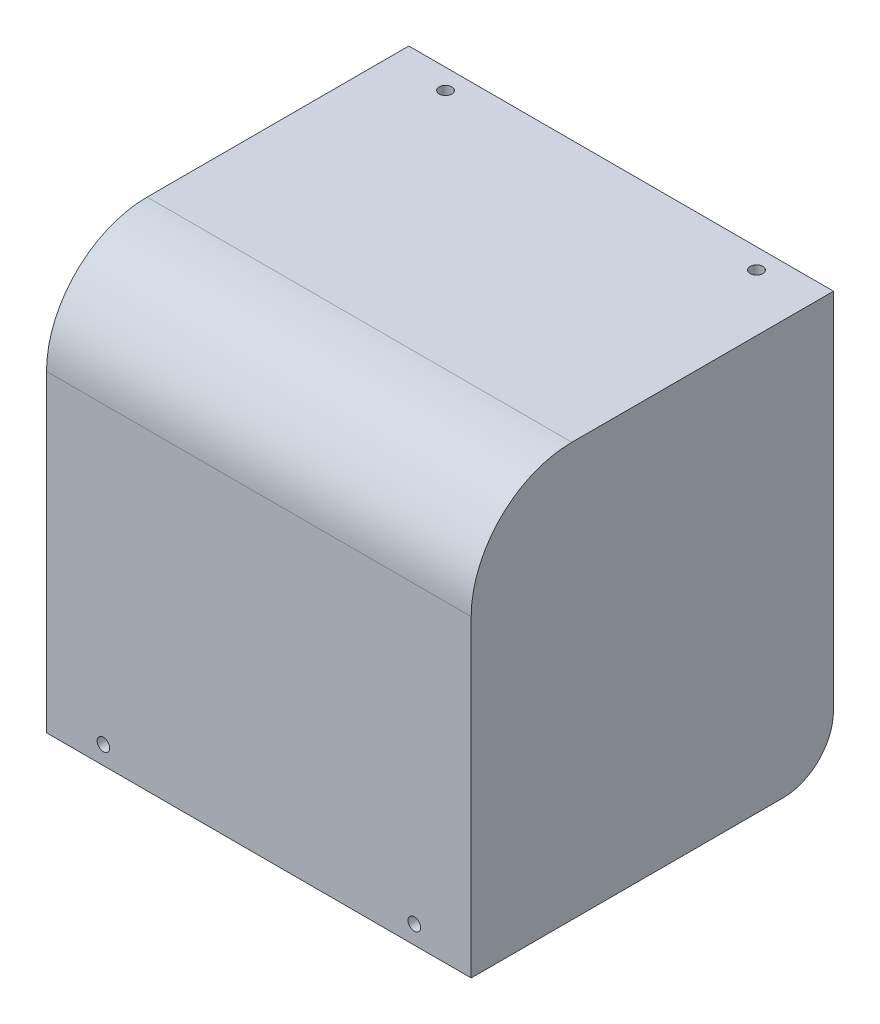
ISO-10303-21;
HEADER;
FILE_DESCRIPTION(('STEP AP214'),'2;1');
FILE_NAME('part.step','',(''),(''),'','','');
FILE_SCHEMA(('AUTOMOTIVE_DESIGN { 1 0 10303 214 1 1 1 1 }'));
ENDSEC;
DATA;
#1=APPLICATION_CONTEXT('core data for automotive mechanical design processes');
#2=APPLICATION_PROTOCOL_DEFINITION('international standard','automotive_design',2000,#1);
#3=PRODUCT_CONTEXT('',#1,'mechanical');
#4=PRODUCT('Part','Part','',(#3));
#5=PRODUCT_RELATED_PRODUCT_CATEGORY('part','',(#4));
#6=PRODUCT_DEFINITION_FORMATION('','',#4);
#7=PRODUCT_DEFINITION_CONTEXT('part definition',#1,'design');
#8=PRODUCT_DEFINITION('design','',#6,#7);
#9=PRODUCT_DEFINITION_SHAPE('','',#8);
#10=(LENGTH_UNIT() NAMED_UNIT(*) SI_UNIT(.MILLI.,.METRE.));
#11=(NAMED_UNIT(*) PLANE_ANGLE_UNIT() SI_UNIT($,.RADIAN.));
#12=(NAMED_UNIT(*) SI_UNIT($,.STERADIAN.) SOLID_ANGLE_UNIT());
#13=UNCERTAINTY_MEASURE_WITH_UNIT(LENGTH_MEASURE(1.E-05),#10,'distance_accuracy_value','');
#14=(GEOMETRIC_REPRESENTATION_CONTEXT(3) GLOBAL_UNCERTAINTY_ASSIGNED_CONTEXT((#13)) GLOBAL_UNIT_ASSIGNED_CONTEXT((#10,
#11,#12)) REPRESENTATION_CONTEXT('',''));
#15=CARTESIAN_POINT('',(0.,0.,0.));
#16=DIRECTION('',(0.,0.,1.));
#17=DIRECTION('',(1.,0.,0.));
#18=AXIS2_PLACEMENT_3D('',#15,#16,#17);
#19=CARTESIAN_POINT('',(42.2,80.2,-1.99999999999999));
#20=DIRECTION('',(0.,0.,1.));
#21=DIRECTION('',(0.,-1.,0.));
#22=AXIS2_PLACEMENT_3D('',#19,#20,#21);
#23=PLANE('',#22);
#24=CARTESIAN_POINT('',(-30.9,3.64,-2.));
#25=DIRECTION('',(0.,0.,1.));
#26=DIRECTION('',(0.,-1.,0.));
#27=AXIS2_PLACEMENT_3D('',#24,#25,#26);
#28=CIRCLE('',#27,1.25);
#29=CARTESIAN_POINT('',(-30.9,2.39,-2.));
#30=VERTEX_POINT('',#29);
#31=EDGE_CURVE('E216',#30,#30,#28,.T.);
#32=ORIENTED_EDGE('',*,*,#31,.T.);
#33=EDGE_LOOP('',(#32));
#34=FACE_BOUND('',#33,.T.);
#35=CARTESIAN_POINT('',(30.9,3.64000000000001,-2.));
#36=DIRECTION('',(0.,0.,1.));
#37=DIRECTION('',(0.,-1.,0.));
#38=AXIS2_PLACEMENT_3D('',#35,#36,#37);
#39=CIRCLE('',#38,1.25);
#40=CARTESIAN_POINT('',(30.9,2.39000000000001,-2.));
#41=VERTEX_POINT('',#40);
#42=EDGE_CURVE('E211',#41,#41,#39,.T.);
#43=ORIENTED_EDGE('',*,*,#42,.T.);
#44=EDGE_LOOP('',(#43));
#45=FACE_BOUND('',#44,.T.);
#46=DIRECTION('',(0.,1.,0.));
#47=VECTOR('',#46,1.);
#48=CARTESIAN_POINT('',(40.2,0.,-2.));
#49=LINE('',#48,#47);
#50=CARTESIAN_POINT('',(40.2,0.,-2.));
#51=VERTEX_POINT('',#50);
#52=CARTESIAN_POINT('',(40.2,60.2,-1.99999999999999));
#53=VERTEX_POINT('',#52);
#54=EDGE_CURVE('E126',#51,#53,#49,.T.);
#55=ORIENTED_EDGE('',*,*,#54,.F.);
#56=DIRECTION('',(-1.,0.,0.));
#57=VECTOR('',#56,1.);
#58=CARTESIAN_POINT('',(42.2,0.,-2.));
#59=LINE('',#58,#57);
#60=CARTESIAN_POINT('',(-40.2,0.,-2.));
#61=VERTEX_POINT('',#60);
#62=EDGE_CURVE('E191',#51,#61,#59,.T.);
#63=ORIENTED_EDGE('',*,*,#62,.T.);
#64=DIRECTION('',(0.,1.,0.));
#65=VECTOR('',#64,1.);
#66=CARTESIAN_POINT('',(-40.2,0.,-2.));
#67=LINE('',#66,#65);
#68=CARTESIAN_POINT('',(-40.2,60.2,-1.99999999999999));
#69=VERTEX_POINT('',#68);
#70=EDGE_CURVE('E203',#61,#69,#67,.T.);
#71=ORIENTED_EDGE('',*,*,#70,.T.);
#72=DIRECTION('',(-1.,0.,0.));
#73=VECTOR('',#72,1.);
#74=CARTESIAN_POINT('',(42.2,60.2,-1.99999999999999));
#75=LINE('',#74,#73);
#76=EDGE_CURVE('E143',#69,#53,#75,.F.);
#77=ORIENTED_EDGE('',*,*,#76,.T.);
#78=EDGE_LOOP('',(#55,#63,#71,#77));
#79=FACE_BOUND('',#78,.T.);
#80=ADVANCED_FACE('F33',(#34,#45,#79),#23,.F.);
#81=CARTESIAN_POINT('',(42.2,80.2,-72.));
#82=DIRECTION('',(0.,1.,0.));
#83=DIRECTION('',(0.,0.,1.));
#84=AXIS2_PLACEMENT_3D('',#81,#82,#83);
#85=PLANE('',#84);
#86=CARTESIAN_POINT('',(-30.9,80.2,-68.001968));
#87=DIRECTION('',(0.,1.,0.));
#88=DIRECTION('',(0.,0.,1.));
#89=AXIS2_PLACEMENT_3D('',#86,#87,#88);
#90=CIRCLE('',#89,1.25);
#91=CARTESIAN_POINT('',(-30.9,80.2,-66.751968));
#92=VERTEX_POINT('',#91);
#93=EDGE_CURVE('E138',#92,#92,#90,.T.);
#94=ORIENTED_EDGE('',*,*,#93,.T.);
#95=EDGE_LOOP('',(#94));
#96=FACE_BOUND('',#95,.T.);
#97=CARTESIAN_POINT('',(30.9,80.2,-68.001968));
#98=DIRECTION('',(0.,1.,0.));
#99=DIRECTION('',(0.,0.,1.));
#100=AXIS2_PLACEMENT_3D('',#97,#98,#99);
#101=CIRCLE('',#100,1.25);
#102=CARTESIAN_POINT('',(30.9,80.2,-66.751968));
#103=VERTEX_POINT('',#102);
#104=EDGE_CURVE('E329',#103,#103,#101,.T.);
#105=ORIENTED_EDGE('',*,*,#104,.T.);
#106=EDGE_LOOP('',(#105));
#107=FACE_BOUND('',#106,.T.);
#108=DIRECTION('',(0.,0.,-1.));
#109=VECTOR('',#108,1.);
#110=CARTESIAN_POINT('',(40.2,80.2,-22.));
#111=LINE('',#110,#109);
#112=CARTESIAN_POINT('',(40.2,80.2,-22.));
#113=VERTEX_POINT('',#112);
#114=CARTESIAN_POINT('',(40.2,80.2,-72.));
#115=VERTEX_POINT('',#114);
#116=EDGE_CURVE('E123',#113,#115,#111,.T.);
#117=ORIENTED_EDGE('',*,*,#116,.F.);
#118=DIRECTION('',(-1.,0.,0.));
#119=VECTOR('',#118,1.);
#120=CARTESIAN_POINT('',(-42.2,80.2,-22.));
#121=LINE('',#120,#119);
#122=CARTESIAN_POINT('',(-40.2,80.2,-22.));
#123=VERTEX_POINT('',#122);
#124=EDGE_CURVE('E135',#113,#123,#121,.T.);
#125=ORIENTED_EDGE('',*,*,#124,.T.);
#126=DIRECTION('',(0.,0.,-1.));
#127=VECTOR('',#126,1.);
#128=CARTESIAN_POINT('',(-40.2,80.2,-22.));
#129=LINE('',#128,#127);
#130=CARTESIAN_POINT('',(-40.2,80.2,-72.));
#131=VERTEX_POINT('',#130);
#132=EDGE_CURVE('E194',#123,#131,#129,.T.);
#133=ORIENTED_EDGE('',*,*,#132,.T.);
#134=DIRECTION('',(-1.,0.,0.));
#135=VECTOR('',#134,1.);
#136=CARTESIAN_POINT('',(42.2,80.2,-72.));
#137=LINE('',#136,#135);
#138=EDGE_CURVE('E137',#115,#131,#137,.T.);
#139=ORIENTED_EDGE('',*,*,#138,.F.);
#140=EDGE_LOOP('',(#117,#125,#133,#139));
#141=FACE_BOUND('',#140,.T.);
#142=ADVANCED_FACE('F133',(#96,#107,#141),#85,.F.);
#143=CARTESIAN_POINT('',(42.2,60.2,-22.));
#144=DIRECTION('',(1.,0.,0.));
#145=DIRECTION('',(0.,0.,-1.));
#146=AXIS2_PLACEMENT_3D('',#143,#144,#145);
#147=CYLINDRICAL_SURFACE('',#146,20.);
#148=CARTESIAN_POINT('',(40.2,60.2,-22.));
#149=DIRECTION('',(-1.,0.,0.));
#150=DIRECTION('',(0.,0.,1.));
#151=AXIS2_PLACEMENT_3D('',#148,#149,#150);
#152=CIRCLE('',#151,20.);
#153=EDGE_CURVE('E120',#53,#113,#152,.T.);
#154=ORIENTED_EDGE('',*,*,#153,.F.);
#155=ORIENTED_EDGE('',*,*,#76,.F.);
#156=CARTESIAN_POINT('',(-40.2,60.2,-22.));
#157=DIRECTION('',(-1.,0.,0.));
#158=DIRECTION('',(0.,0.,1.));
#159=AXIS2_PLACEMENT_3D('',#156,#157,#158);
#160=CIRCLE('',#159,20.);
#161=EDGE_CURVE('E142',#69,#123,#160,.T.);
#162=ORIENTED_EDGE('',*,*,#161,.T.);
#163=ORIENTED_EDGE('',*,*,#124,.F.);
#164=EDGE_LOOP('',(#154,#155,#162,#163));
#165=FACE_BOUND('',#164,.T.);
#166=ADVANCED_FACE('F141',(#165),#147,.F.);
#167=CARTESIAN_POINT('',(42.2,0.,-2.));
#168=DIRECTION('',(0.,1.,0.));
#169=DIRECTION('',(0.,0.,1.));
#170=AXIS2_PLACEMENT_3D('',#167,#168,#169);
#171=PLANE('',#170);
#172=DIRECTION('',(0.,0.,-1.));
#173=VECTOR('',#172,1.);
#174=CARTESIAN_POINT('',(-42.2,0.,-2.));
#175=LINE('',#174,#173);
#176=CARTESIAN_POINT('',(-42.2,0.,0.));
#177=VERTEX_POINT('',#176);
#178=CARTESIAN_POINT('',(-42.2,0.,-62.));
#179=VERTEX_POINT('',#178);
#180=EDGE_CURVE('E219',#177,#179,#175,.T.);
#181=ORIENTED_EDGE('',*,*,#180,.T.);
#182=DIRECTION('',(-1.,0.,0.));
#183=VECTOR('',#182,1.);
#184=CARTESIAN_POINT('',(42.2,0.,-62.));
#185=LINE('',#184,#183);
#186=CARTESIAN_POINT('',(-40.2,0.,-62.));
#187=VERTEX_POINT('',#186);
#188=EDGE_CURVE('E164',#179,#187,#185,.F.);
#189=ORIENTED_EDGE('',*,*,#188,.T.);
#190=DIRECTION('',(0.,0.,1.));
#191=VECTOR('',#190,1.);
#192=CARTESIAN_POINT('',(-40.2,0.,-72.));
#193=LINE('',#192,#191);
#194=EDGE_CURVE('E201',#187,#61,#193,.T.);
#195=ORIENTED_EDGE('',*,*,#194,.T.);
#196=ORIENTED_EDGE('',*,*,#62,.F.);
#197=DIRECTION('',(0.,0.,1.));
#198=VECTOR('',#197,1.);
#199=CARTESIAN_POINT('',(40.2,0.,-72.));
#200=LINE('',#199,#198);
#201=CARTESIAN_POINT('',(40.2,0.,-62.));
#202=VERTEX_POINT('',#201);
#203=EDGE_CURVE('E189',#202,#51,#200,.T.);
#204=ORIENTED_EDGE('',*,*,#203,.F.);
#205=DIRECTION('',(1.,0.,0.));
#206=VECTOR('',#205,1.);
#207=CARTESIAN_POINT('',(42.2,0.,-62.));
#208=LINE('',#207,#206);
#209=CARTESIAN_POINT('',(42.2,0.,-62.));
#210=VERTEX_POINT('',#209);
#211=EDGE_CURVE('E162',#202,#210,#208,.T.);
#212=ORIENTED_EDGE('',*,*,#211,.T.);
#213=DIRECTION('',(0.,0.,-1.));
#214=VECTOR('',#213,1.);
#215=CARTESIAN_POINT('',(42.2,0.,-2.));
#216=LINE('',#215,#214);
#217=CARTESIAN_POINT('',(42.2,0.,0.));
#218=VERTEX_POINT('',#217);
#219=EDGE_CURVE('E175',#218,#210,#216,.T.);
#220=ORIENTED_EDGE('',*,*,#219,.F.);
#221=DIRECTION('',(-1.,0.,0.));
#222=VECTOR('',#221,1.);
#223=CARTESIAN_POINT('',(42.2,0.,0.));
#224=LINE('',#223,#222);
#225=EDGE_CURVE('E225',#218,#177,#224,.T.);
#226=ORIENTED_EDGE('',*,*,#225,.T.);
#227=EDGE_LOOP('',(#181,#189,#195,#196,#204,#212,#220,#226));
#228=FACE_BOUND('',#227,.T.);
#229=ADVANCED_FACE('F186',(#228),#171,.F.);
#230=CARTESIAN_POINT('',(42.2,82.2,-72.));
#231=DIRECTION('',(0.,0.,1.));
#232=DIRECTION('',(1.,0.,0.));
#233=AXIS2_PLACEMENT_3D('',#230,#231,#232);
#234=PLANE('',#233);
#235=DIRECTION('',(0.,-1.,0.));
#236=VECTOR('',#235,1.);
#237=CARTESIAN_POINT('',(-40.2,80.2,-72.));
#238=LINE('',#237,#236);
#239=CARTESIAN_POINT('',(-40.2,9.99999999999995,-72.));
#240=VERTEX_POINT('',#239);
#241=EDGE_CURVE('E199',#131,#240,#238,.T.);
#242=ORIENTED_EDGE('',*,*,#241,.T.);
#243=DIRECTION('',(-1.,0.,0.));
#244=VECTOR('',#243,1.);
#245=CARTESIAN_POINT('',(42.2,9.99999999999995,-72.));
#246=LINE('',#245,#244);
#247=CARTESIAN_POINT('',(-42.2,9.99999999999995,-72.));
#248=VERTEX_POINT('',#247);
#249=EDGE_CURVE('E157',#240,#248,#246,.T.);
#250=ORIENTED_EDGE('',*,*,#249,.T.);
#251=DIRECTION('',(0.,1.,0.));
#252=VECTOR('',#251,1.);
#253=CARTESIAN_POINT('',(-42.2,82.2,-72.));
#254=LINE('',#253,#252);
#255=CARTESIAN_POINT('',(-42.2,82.2,-72.));
#256=VERTEX_POINT('',#255);
#257=EDGE_CURVE('E227',#248,#256,#254,.T.);
#258=ORIENTED_EDGE('',*,*,#257,.T.);
#259=DIRECTION('',(-1.,0.,0.));
#260=VECTOR('',#259,1.);
#261=CARTESIAN_POINT('',(42.2,82.2,-72.));
#262=LINE('',#261,#260);
#263=CARTESIAN_POINT('',(42.2,82.2,-72.));
#264=VERTEX_POINT('',#263);
#265=EDGE_CURVE('E180',#264,#256,#262,.T.);
#266=ORIENTED_EDGE('',*,*,#265,.F.);
#267=DIRECTION('',(0.,1.,0.));
#268=VECTOR('',#267,1.);
#269=CARTESIAN_POINT('',(42.2,82.2,-72.));
#270=LINE('',#269,#268);
#271=CARTESIAN_POINT('',(42.2,9.99999999999997,-72.));
#272=VERTEX_POINT('',#271);
#273=EDGE_CURVE('E172',#272,#264,#270,.T.);
#274=ORIENTED_EDGE('',*,*,#273,.F.);
#275=DIRECTION('',(1.,0.,0.));
#276=VECTOR('',#275,1.);
#277=CARTESIAN_POINT('',(42.2,9.99999999999997,-72.));
#278=LINE('',#277,#276);
#279=CARTESIAN_POINT('',(40.2,9.99999999999997,-72.));
#280=VERTEX_POINT('',#279);
#281=EDGE_CURVE('E155',#272,#280,#278,.F.);
#282=ORIENTED_EDGE('',*,*,#281,.T.);
#283=DIRECTION('',(0.,-1.,0.));
#284=VECTOR('',#283,1.);
#285=CARTESIAN_POINT('',(40.2,80.2,-72.));
#286=LINE('',#285,#284);
#287=EDGE_CURVE('E192',#115,#280,#286,.T.);
#288=ORIENTED_EDGE('',*,*,#287,.F.);
#289=ORIENTED_EDGE('',*,*,#138,.T.);
#290=EDGE_LOOP('',(#242,#250,#258,#266,#274,#282,#288,#289));
#291=FACE_BOUND('',#290,.T.);
#292=ADVANCED_FACE('F178',(#291),#234,.F.);
#293=CARTESIAN_POINT('',(42.2,82.2,0.));
#294=DIRECTION('',(0.,-1.,0.));
#295=DIRECTION('',(0.,0.,-1.));
#296=AXIS2_PLACEMENT_3D('',#293,#294,#295);
#297=PLANE('',#296);
#298=CARTESIAN_POINT('',(-30.9,82.2,-68.001968));
#299=DIRECTION('',(0.,1.,0.));
#300=DIRECTION('',(0.,0.,1.));
#301=AXIS2_PLACEMENT_3D('',#298,#299,#300);
#302=CIRCLE('',#301,1.25);
#303=CARTESIAN_POINT('',(-30.9,82.2,-66.751968));
#304=VERTEX_POINT('',#303);
#305=EDGE_CURVE('E323',#304,#304,#302,.T.);
#306=ORIENTED_EDGE('',*,*,#305,.F.);
#307=EDGE_LOOP('',(#306));
#308=FACE_BOUND('',#307,.T.);
#309=CARTESIAN_POINT('',(30.9,82.2,-68.001968));
#310=DIRECTION('',(0.,1.,0.));
#311=DIRECTION('',(0.,0.,1.));
#312=AXIS2_PLACEMENT_3D('',#309,#310,#311);
#313=CIRCLE('',#312,1.25);
#314=CARTESIAN_POINT('',(30.9,82.2,-66.751968));
#315=VERTEX_POINT('',#314);
#316=EDGE_CURVE('E326',#315,#315,#313,.T.);
#317=ORIENTED_EDGE('',*,*,#316,.F.);
#318=EDGE_LOOP('',(#317));
#319=FACE_BOUND('',#318,.T.);
#320=DIRECTION('',(0.,0.,1.));
#321=VECTOR('',#320,1.);
#322=CARTESIAN_POINT('',(-42.2,82.2,0.));
#323=LINE('',#322,#321);
#324=CARTESIAN_POINT('',(-42.2,82.2,-20.));
#325=VERTEX_POINT('',#324);
#326=EDGE_CURVE('E229',#256,#325,#323,.T.);
#327=ORIENTED_EDGE('',*,*,#326,.T.);
#328=DIRECTION('',(-1.,0.,0.));
#329=VECTOR('',#328,1.);
#330=CARTESIAN_POINT('',(42.2,82.2,-20.));
#331=LINE('',#330,#329);
#332=CARTESIAN_POINT('',(42.2,82.2,-20.));
#333=VERTEX_POINT('',#332);
#334=EDGE_CURVE('E144',#325,#333,#331,.F.);
#335=ORIENTED_EDGE('',*,*,#334,.T.);
#336=DIRECTION('',(0.,0.,1.));
#337=VECTOR('',#336,1.);
#338=CARTESIAN_POINT('',(42.2,82.2,0.));
#339=LINE('',#338,#337);
#340=EDGE_CURVE('E182',#264,#333,#339,.T.);
#341=ORIENTED_EDGE('',*,*,#340,.F.);
#342=ORIENTED_EDGE('',*,*,#265,.T.);
#343=EDGE_LOOP('',(#327,#335,#341,#342));
#344=FACE_BOUND('',#343,.T.);
#345=ADVANCED_FACE('F262',(#308,#319,#344),#297,.F.);
#346=CARTESIAN_POINT('',(42.2,0.,0.));
#347=DIRECTION('',(0.,0.,-1.));
#348=DIRECTION('',(-1.,0.,0.));
#349=AXIS2_PLACEMENT_3D('',#346,#347,#348);
#350=PLANE('',#349);
#351=CARTESIAN_POINT('',(-30.9,3.64,0.));
#352=DIRECTION('',(0.,0.,1.));
#353=DIRECTION('',(1.,0.,0.));
#354=AXIS2_PLACEMENT_3D('',#351,#352,#353);
#355=CIRCLE('',#354,1.25);
#356=CARTESIAN_POINT('',(-29.65,3.64,0.));
#357=VERTEX_POINT('',#356);
#358=EDGE_CURVE('E208',#357,#357,#355,.T.);
#359=ORIENTED_EDGE('',*,*,#358,.F.);
#360=EDGE_LOOP('',(#359));
#361=FACE_BOUND('',#360,.T.);
#362=CARTESIAN_POINT('',(30.9,3.64000000000001,0.));
#363=DIRECTION('',(0.,0.,1.));
#364=DIRECTION('',(1.,0.,0.));
#365=AXIS2_PLACEMENT_3D('',#362,#363,#364);
#366=CIRCLE('',#365,1.25);
#367=CARTESIAN_POINT('',(32.15,3.64000000000001,0.));
#368=VERTEX_POINT('',#367);
#369=EDGE_CURVE('E207',#368,#368,#366,.T.);
#370=ORIENTED_EDGE('',*,*,#369,.F.);
#371=EDGE_LOOP('',(#370));
#372=FACE_BOUND('',#371,.T.);
#373=DIRECTION('',(0.,-1.,0.));
#374=VECTOR('',#373,1.);
#375=CARTESIAN_POINT('',(42.2,0.,0.));
#376=LINE('',#375,#374);
#377=CARTESIAN_POINT('',(42.2,62.2,0.));
#378=VERTEX_POINT('',#377);
#379=EDGE_CURVE('E223',#378,#218,#376,.T.);
#380=ORIENTED_EDGE('',*,*,#379,.F.);
#381=DIRECTION('',(-1.,0.,0.));
#382=VECTOR('',#381,1.);
#383=CARTESIAN_POINT('',(42.2,62.2,0.));
#384=LINE('',#383,#382);
#385=CARTESIAN_POINT('',(-42.2,62.2,0.));
#386=VERTEX_POINT('',#385);
#387=EDGE_CURVE('E148',#378,#386,#384,.T.);
#388=ORIENTED_EDGE('',*,*,#387,.T.);
#389=DIRECTION('',(0.,-1.,0.));
#390=VECTOR('',#389,1.);
#391=CARTESIAN_POINT('',(-42.2,0.,0.));
#392=LINE('',#391,#390);
#393=EDGE_CURVE('E220',#386,#177,#392,.T.);
#394=ORIENTED_EDGE('',*,*,#393,.T.);
#395=ORIENTED_EDGE('',*,*,#225,.F.);
#396=EDGE_LOOP('',(#380,#388,#394,#395));
#397=FACE_BOUND('',#396,.T.);
#398=ADVANCED_FACE('F241',(#361,#372,#397),#350,.F.);
#399=CARTESIAN_POINT('',(42.2,0.,0.));
#400=DIRECTION('',(-1.,0.,0.));
#401=DIRECTION('',(0.,0.,1.));
#402=AXIS2_PLACEMENT_3D('',#399,#400,#401);
#403=PLANE('',#402);
#404=ORIENTED_EDGE('',*,*,#219,.T.);
#405=CARTESIAN_POINT('',(42.2,9.99999999999996,-62.));
#406=DIRECTION('',(-1.,0.,0.));
#407=DIRECTION('',(0.,0.,1.));
#408=AXIS2_PLACEMENT_3D('',#405,#406,#407);
#409=CIRCLE('',#408,10.);
#410=EDGE_CURVE('E41',#210,#272,#409,.F.);
#411=ORIENTED_EDGE('',*,*,#410,.T.);
#412=ORIENTED_EDGE('',*,*,#273,.T.);
#413=ORIENTED_EDGE('',*,*,#340,.T.);
#414=CARTESIAN_POINT('',(42.2,62.2,-20.));
#415=DIRECTION('',(-1.,0.,0.));
#416=DIRECTION('',(0.,0.,1.));
#417=AXIS2_PLACEMENT_3D('',#414,#415,#416);
#418=CIRCLE('',#417,20.);
#419=EDGE_CURVE('E153',#333,#378,#418,.F.);
#420=ORIENTED_EDGE('',*,*,#419,.T.);
#421=ORIENTED_EDGE('',*,*,#379,.T.);
#422=EDGE_LOOP('',(#404,#411,#412,#413,#420,#421));
#423=FACE_BOUND('',#422,.T.);
#424=ADVANCED_FACE('F170',(#423),#403,.F.);
#425=CARTESIAN_POINT('',(-42.2,0.,0.));
#426=DIRECTION('',(-1.,0.,0.));
#427=DIRECTION('',(0.,0.,1.));
#428=AXIS2_PLACEMENT_3D('',#425,#426,#427);
#429=PLANE('',#428);
#430=ORIENTED_EDGE('',*,*,#257,.F.);
#431=CARTESIAN_POINT('',(-42.2,9.99999999999995,-62.));
#432=DIRECTION('',(-1.,0.,0.));
#433=DIRECTION('',(0.,0.,1.));
#434=AXIS2_PLACEMENT_3D('',#431,#432,#433);
#435=CIRCLE('',#434,10.);
#436=EDGE_CURVE('E160',#248,#179,#435,.T.);
#437=ORIENTED_EDGE('',*,*,#436,.T.);
#438=ORIENTED_EDGE('',*,*,#180,.F.);
#439=ORIENTED_EDGE('',*,*,#393,.F.);
#440=CARTESIAN_POINT('',(-42.2,62.2,-20.));
#441=DIRECTION('',(-1.,0.,0.));
#442=DIRECTION('',(0.,0.,1.));
#443=AXIS2_PLACEMENT_3D('',#440,#441,#442);
#444=CIRCLE('',#443,20.);
#445=EDGE_CURVE('E146',#386,#325,#444,.T.);
#446=ORIENTED_EDGE('',*,*,#445,.T.);
#447=ORIENTED_EDGE('',*,*,#326,.F.);
#448=EDGE_LOOP('',(#430,#437,#438,#439,#446,#447));
#449=FACE_BOUND('',#448,.T.);
#450=ADVANCED_FACE('F248',(#449),#429,.T.);
#451=CARTESIAN_POINT('',(30.9,3.64000000000001,-70.));
#452=DIRECTION('',(0.,0.,1.));
#453=DIRECTION('',(1.,0.,0.));
#454=AXIS2_PLACEMENT_3D('',#451,#452,#453);
#455=CYLINDRICAL_SURFACE('',#454,1.25);
#456=ORIENTED_EDGE('',*,*,#369,.T.);
#457=EDGE_LOOP('',(#456));
#458=FACE_BOUND('',#457,.T.);
#459=ORIENTED_EDGE('',*,*,#42,.F.);
#460=EDGE_LOOP('',(#459));
#461=FACE_BOUND('',#460,.T.);
#462=ADVANCED_FACE('F272',(#458,#461),#455,.F.);
#463=CARTESIAN_POINT('',(-30.9,3.64,-70.));
#464=DIRECTION('',(0.,0.,1.));
#465=DIRECTION('',(1.,0.,0.));
#466=AXIS2_PLACEMENT_3D('',#463,#464,#465);
#467=CYLINDRICAL_SURFACE('',#466,1.25);
#468=ORIENTED_EDGE('',*,*,#358,.T.);
#469=EDGE_LOOP('',(#468));
#470=FACE_BOUND('',#469,.T.);
#471=ORIENTED_EDGE('',*,*,#31,.F.);
#472=EDGE_LOOP('',(#471));
#473=FACE_BOUND('',#472,.T.);
#474=ADVANCED_FACE('F265',(#470,#473),#467,.F.);
#475=CARTESIAN_POINT('',(42.2,62.2,-20.));
#476=DIRECTION('',(-1.,0.,0.));
#477=DIRECTION('',(0.,0.,1.));
#478=AXIS2_PLACEMENT_3D('',#475,#476,#477);
#479=CYLINDRICAL_SURFACE('',#478,20.);
#480=ORIENTED_EDGE('',*,*,#419,.F.);
#481=ORIENTED_EDGE('',*,*,#334,.F.);
#482=ORIENTED_EDGE('',*,*,#445,.F.);
#483=ORIENTED_EDGE('',*,*,#387,.F.);
#484=EDGE_LOOP('',(#480,#481,#482,#483));
#485=FACE_BOUND('',#484,.T.);
#486=ADVANCED_FACE('F263',(#485),#479,.T.);
#487=CARTESIAN_POINT('',(-40.2,60.2,-22.));
#488=DIRECTION('',(-1.,0.,0.));
#489=DIRECTION('',(0.,0.,1.));
#490=AXIS2_PLACEMENT_3D('',#487,#488,#489);
#491=PLANE('',#490);
#492=ORIENTED_EDGE('',*,*,#194,.F.);
#493=CARTESIAN_POINT('',(-40.2,9.99999999999995,-62.));
#494=DIRECTION('',(-1.,0.,0.));
#495=DIRECTION('',(0.,0.,1.));
#496=AXIS2_PLACEMENT_3D('',#493,#494,#495);
#497=CIRCLE('',#496,10.);
#498=EDGE_CURVE('E166',#187,#240,#497,.F.);
#499=ORIENTED_EDGE('',*,*,#498,.T.);
#500=ORIENTED_EDGE('',*,*,#241,.F.);
#501=ORIENTED_EDGE('',*,*,#132,.F.);
#502=ORIENTED_EDGE('',*,*,#161,.F.);
#503=ORIENTED_EDGE('',*,*,#70,.F.);
#504=EDGE_LOOP('',(#492,#499,#500,#501,#502,#503));
#505=FACE_BOUND('',#504,.T.);
#506=ADVANCED_FACE('F258',(#505),#491,.F.);
#507=CARTESIAN_POINT('',(40.2,60.2,-22.));
#508=DIRECTION('',(1.,0.,0.));
#509=DIRECTION('',(0.,0.,1.));
#510=AXIS2_PLACEMENT_3D('',#507,#508,#509);
#511=PLANE('',#510);
#512=ORIENTED_EDGE('',*,*,#287,.T.);
#513=CARTESIAN_POINT('',(40.2,9.99999999999996,-62.));
#514=DIRECTION('',(1.,0.,0.));
#515=DIRECTION('',(0.,0.,-1.));
#516=AXIS2_PLACEMENT_3D('',#513,#514,#515);
#517=CIRCLE('',#516,10.);
#518=EDGE_CURVE('E11',#280,#202,#517,.F.);
#519=ORIENTED_EDGE('',*,*,#518,.T.);
#520=ORIENTED_EDGE('',*,*,#203,.T.);
#521=ORIENTED_EDGE('',*,*,#54,.T.);
#522=ORIENTED_EDGE('',*,*,#153,.T.);
#523=ORIENTED_EDGE('',*,*,#116,.T.);
#524=EDGE_LOOP('',(#512,#519,#520,#521,#522,#523));
#525=FACE_BOUND('',#524,.T.);
#526=ADVANCED_FACE('F122',(#525),#511,.F.);
#527=CARTESIAN_POINT('',(42.2,9.99999999999995,-62.));
#528=DIRECTION('',(-1.,0.,0.));
#529=DIRECTION('',(0.,0.,1.));
#530=AXIS2_PLACEMENT_3D('',#527,#528,#529);
#531=CYLINDRICAL_SURFACE('',#530,10.);
#532=ORIENTED_EDGE('',*,*,#498,.F.);
#533=ORIENTED_EDGE('',*,*,#188,.F.);
#534=ORIENTED_EDGE('',*,*,#436,.F.);
#535=ORIENTED_EDGE('',*,*,#249,.F.);
#536=EDGE_LOOP('',(#532,#533,#534,#535));
#537=FACE_BOUND('',#536,.T.);
#538=ADVANCED_FACE('F254',(#537),#531,.T.);
#539=CARTESIAN_POINT('',(42.2,9.99999999999996,-62.));
#540=DIRECTION('',(1.,0.,0.));
#541=DIRECTION('',(0.,0.,-1.));
#542=AXIS2_PLACEMENT_3D('',#539,#540,#541);
#543=CYLINDRICAL_SURFACE('',#542,10.);
#544=ORIENTED_EDGE('',*,*,#518,.F.);
#545=ORIENTED_EDGE('',*,*,#281,.F.);
#546=ORIENTED_EDGE('',*,*,#410,.F.);
#547=ORIENTED_EDGE('',*,*,#211,.F.);
#548=EDGE_LOOP('',(#544,#545,#546,#547));
#549=FACE_BOUND('',#548,.T.);
#550=ADVANCED_FACE('F35',(#549),#543,.T.);
#551=CARTESIAN_POINT('',(30.9,72.2,-68.001968));
#552=DIRECTION('',(0.,1.,0.));
#553=DIRECTION('',(0.,0.,1.));
#554=AXIS2_PLACEMENT_3D('',#551,#552,#553);
#555=CYLINDRICAL_SURFACE('',#554,1.25);
#556=ORIENTED_EDGE('',*,*,#316,.T.);
#557=EDGE_LOOP('',(#556));
#558=FACE_BOUND('',#557,.T.);
#559=ORIENTED_EDGE('',*,*,#104,.F.);
#560=EDGE_LOOP('',(#559));
#561=FACE_BOUND('',#560,.T.);
#562=ADVANCED_FACE('F299',(#558,#561),#555,.F.);
#563=CARTESIAN_POINT('',(-30.9,72.2,-68.001968));
#564=DIRECTION('',(0.,1.,0.));
#565=DIRECTION('',(0.,0.,1.));
#566=AXIS2_PLACEMENT_3D('',#563,#564,#565);
#567=CYLINDRICAL_SURFACE('',#566,1.25);
#568=ORIENTED_EDGE('',*,*,#305,.T.);
#569=EDGE_LOOP('',(#568));
#570=FACE_BOUND('',#569,.T.);
#571=ORIENTED_EDGE('',*,*,#93,.F.);
#572=EDGE_LOOP('',(#571));
#573=FACE_BOUND('',#572,.T.);
#574=ADVANCED_FACE('F338',(#570,#573),#567,.F.);
#575=CLOSED_SHELL('',(#80,#142,#166,#229,#292,#345,#398,#424,#450,#462,#474,#486,#506,#526,#538,
#550,#562,#574));
#576=MANIFOLD_SOLID_BREP('B2',#575);
#577=ADVANCED_BREP_SHAPE_REPRESENTATION('',(#18,#576),#14);
#578=SHAPE_DEFINITION_REPRESENTATION(#9,#577);
ENDSEC;
END-ISO-10303-21;
